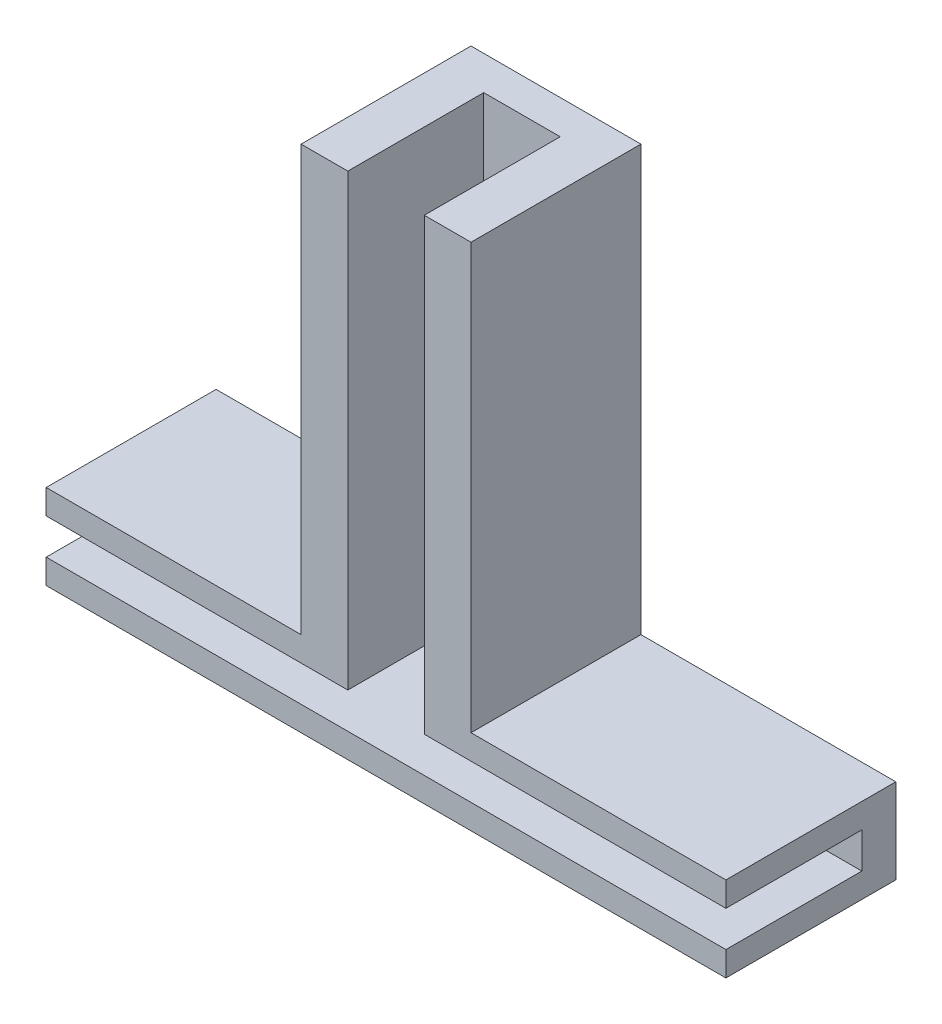
ISO-10303-21;
HEADER;
FILE_DESCRIPTION(('STEP AP214'),'2;1');
FILE_NAME('part.step','',(''),(''),'','','');
FILE_SCHEMA(('AUTOMOTIVE_DESIGN { 1 0 10303 214 1 1 1 1 }'));
ENDSEC;
DATA;
#1=APPLICATION_CONTEXT('core data for automotive mechanical design processes');
#2=APPLICATION_PROTOCOL_DEFINITION('international standard','automotive_design',2000,#1);
#3=PRODUCT_CONTEXT('',#1,'mechanical');
#4=PRODUCT('Part','Part','',(#3));
#5=PRODUCT_RELATED_PRODUCT_CATEGORY('part','',(#4));
#6=PRODUCT_DEFINITION_FORMATION('','',#4);
#7=PRODUCT_DEFINITION_CONTEXT('part definition',#1,'design');
#8=PRODUCT_DEFINITION('design','',#6,#7);
#9=PRODUCT_DEFINITION_SHAPE('','',#8);
#10=(LENGTH_UNIT() NAMED_UNIT(*) SI_UNIT(.MILLI.,.METRE.));
#11=(NAMED_UNIT(*) PLANE_ANGLE_UNIT() SI_UNIT($,.RADIAN.));
#12=(NAMED_UNIT(*) SI_UNIT($,.STERADIAN.) SOLID_ANGLE_UNIT());
#13=UNCERTAINTY_MEASURE_WITH_UNIT(LENGTH_MEASURE(1.E-05),#10,'distance_accuracy_value','');
#14=(GEOMETRIC_REPRESENTATION_CONTEXT(3) GLOBAL_UNCERTAINTY_ASSIGNED_CONTEXT((#13)) GLOBAL_UNIT_ASSIGNED_CONTEXT((#10,
#11,#12)) REPRESENTATION_CONTEXT('',''));
#15=CARTESIAN_POINT('',(0.,0.,0.));
#16=DIRECTION('',(0.,0.,1.));
#17=DIRECTION('',(1.,0.,0.));
#18=AXIS2_PLACEMENT_3D('',#15,#16,#17);
#19=CARTESIAN_POINT('',(-20.,5.,5.));
#20=DIRECTION('',(0.,0.,-1.));
#21=DIRECTION('',(-1.,0.,0.));
#22=AXIS2_PLACEMENT_3D('',#19,#20,#21);
#23=PLANE('',#22);
#24=DIRECTION('',(0.,-1.,0.));
#25=VECTOR('',#24,1.);
#26=CARTESIAN_POINT('',(2.25,0.,5.));
#27=LINE('',#26,#25);
#28=CARTESIAN_POINT('',(2.25,30.,5.));
#29=VERTEX_POINT('',#28);
#30=CARTESIAN_POINT('',(2.25,3.55,5.));
#31=VERTEX_POINT('',#30);
#32=EDGE_CURVE('E171',#29,#31,#27,.T.);
#33=ORIENTED_EDGE('',*,*,#32,.T.);
#34=DIRECTION('',(1.,0.,0.));
#35=VECTOR('',#34,1.);
#36=CARTESIAN_POINT('',(-20.,3.55,5.));
#37=LINE('',#36,#35);
#38=CARTESIAN_POINT('',(20.,3.55,5.));
#39=VERTEX_POINT('',#38);
#40=EDGE_CURVE('E220',#31,#39,#37,.T.);
#41=ORIENTED_EDGE('',*,*,#40,.T.);
#42=DIRECTION('',(0.,-1.,0.));
#43=VECTOR('',#42,1.);
#44=CARTESIAN_POINT('',(20.,5.,5.));
#45=LINE('',#44,#43);
#46=CARTESIAN_POINT('',(20.,5.,5.));
#47=VERTEX_POINT('',#46);
#48=EDGE_CURVE('E262',#47,#39,#45,.T.);
#49=ORIENTED_EDGE('',*,*,#48,.F.);
#50=DIRECTION('',(1.,0.,0.));
#51=VECTOR('',#50,1.);
#52=CARTESIAN_POINT('',(-20.,5.,5.));
#53=LINE('',#52,#51);
#54=CARTESIAN_POINT('',(5.,5.,5.));
#55=VERTEX_POINT('',#54);
#56=EDGE_CURVE('E248',#55,#47,#53,.T.);
#57=ORIENTED_EDGE('',*,*,#56,.F.);
#58=DIRECTION('',(0.,1.,0.));
#59=VECTOR('',#58,1.);
#60=CARTESIAN_POINT('',(5.,0.,5.));
#61=LINE('',#60,#59);
#62=CARTESIAN_POINT('',(5.,30.,5.));
#63=VERTEX_POINT('',#62);
#64=EDGE_CURVE('E183',#55,#63,#61,.T.);
#65=ORIENTED_EDGE('',*,*,#64,.T.);
#66=DIRECTION('',(-1.,0.,0.));
#67=VECTOR('',#66,1.);
#68=CARTESIAN_POINT('',(0.,30.,5.));
#69=LINE('',#68,#67);
#70=EDGE_CURVE('E190',#63,#29,#69,.T.);
#71=ORIENTED_EDGE('',*,*,#70,.T.);
#72=EDGE_LOOP('',(#33,#41,#49,#57,#65,#71));
#73=FACE_BOUND('',#72,.T.);
#74=ADVANCED_FACE('F43',(#73),#23,.F.);
#75=CARTESIAN_POINT('',(-20.,3.55,5.));
#76=DIRECTION('',(0.,1.,0.));
#77=DIRECTION('',(0.,0.,1.));
#78=AXIS2_PLACEMENT_3D('',#75,#76,#77);
#79=PLANE('',#78);
#80=DIRECTION('',(0.,0.,1.));
#81=VECTOR('',#80,1.);
#82=CARTESIAN_POINT('',(2.25,3.55,-3.));
#83=LINE('',#82,#81);
#84=CARTESIAN_POINT('',(2.25,3.55,-3.));
#85=VERTEX_POINT('',#84);
#86=EDGE_CURVE('E178',#85,#31,#83,.T.);
#87=ORIENTED_EDGE('',*,*,#86,.F.);
#88=DIRECTION('',(1.,0.,0.));
#89=VECTOR('',#88,1.);
#90=CARTESIAN_POINT('',(-20.,3.55,-3.));
#91=LINE('',#90,#89);
#92=CARTESIAN_POINT('',(20.,3.55,-3.));
#93=VERTEX_POINT('',#92);
#94=EDGE_CURVE('E230',#85,#93,#91,.T.);
#95=ORIENTED_EDGE('',*,*,#94,.T.);
#96=DIRECTION('',(0.,0.,1.));
#97=VECTOR('',#96,1.);
#98=CARTESIAN_POINT('',(20.,3.55,5.));
#99=LINE('',#98,#97);
#100=EDGE_CURVE('E204',#93,#39,#99,.T.);
#101=ORIENTED_EDGE('',*,*,#100,.T.);
#102=ORIENTED_EDGE('',*,*,#40,.F.);
#103=EDGE_LOOP('',(#87,#95,#101,#102));
#104=FACE_BOUND('',#103,.T.);
#105=ADVANCED_FACE('F319',(#104),#79,.F.);
#106=CARTESIAN_POINT('',(0.,30.,5.));
#107=DIRECTION('',(0.,-1.,0.));
#108=DIRECTION('',(0.,0.,-1.));
#109=AXIS2_PLACEMENT_3D('',#106,#107,#108);
#110=PLANE('',#109);
#111=DIRECTION('',(0.,0.,1.));
#112=VECTOR('',#111,1.);
#113=CARTESIAN_POINT('',(2.25,30.,-3.));
#114=LINE('',#113,#112);
#115=CARTESIAN_POINT('',(2.25,30.,-3.));
#116=VERTEX_POINT('',#115);
#117=EDGE_CURVE('E197',#116,#29,#114,.T.);
#118=ORIENTED_EDGE('',*,*,#117,.T.);
#119=ORIENTED_EDGE('',*,*,#70,.F.);
#120=DIRECTION('',(0.,0.,-1.));
#121=VECTOR('',#120,1.);
#122=CARTESIAN_POINT('',(5.,30.,5.));
#123=LINE('',#122,#121);
#124=CARTESIAN_POINT('',(5.,30.,-5.));
#125=VERTEX_POINT('',#124);
#126=EDGE_CURVE('E201',#63,#125,#123,.T.);
#127=ORIENTED_EDGE('',*,*,#126,.T.);
#128=DIRECTION('',(-1.,0.,0.));
#129=VECTOR('',#128,1.);
#130=CARTESIAN_POINT('',(0.,30.,-5.));
#131=LINE('',#130,#129);
#132=CARTESIAN_POINT('',(-5.,30.,-5.));
#133=VERTEX_POINT('',#132);
#134=EDGE_CURVE('E187',#125,#133,#131,.T.);
#135=ORIENTED_EDGE('',*,*,#134,.T.);
#136=DIRECTION('',(0.,0.,-1.));
#137=VECTOR('',#136,1.);
#138=CARTESIAN_POINT('',(-5.,30.,5.));
#139=LINE('',#138,#137);
#140=CARTESIAN_POINT('',(-5.,30.,5.));
#141=VERTEX_POINT('',#140);
#142=EDGE_CURVE('E205',#141,#133,#139,.T.);
#143=ORIENTED_EDGE('',*,*,#142,.F.);
#144=CARTESIAN_POINT('',(-2.25,30.,5.));
#145=VERTEX_POINT('',#144);
#146=EDGE_CURVE('E176',#145,#141,#69,.T.);
#147=ORIENTED_EDGE('',*,*,#146,.F.);
#148=DIRECTION('',(0.,0.,1.));
#149=VECTOR('',#148,1.);
#150=CARTESIAN_POINT('',(-2.25,30.,-3.));
#151=LINE('',#150,#149);
#152=CARTESIAN_POINT('',(-2.25,30.,-3.));
#153=VERTEX_POINT('',#152);
#154=EDGE_CURVE('E159',#153,#145,#151,.T.);
#155=ORIENTED_EDGE('',*,*,#154,.F.);
#156=DIRECTION('',(-1.,0.,0.));
#157=VECTOR('',#156,1.);
#158=CARTESIAN_POINT('',(0.,30.,-3.));
#159=LINE('',#158,#157);
#160=EDGE_CURVE('E164',#116,#153,#159,.T.);
#161=ORIENTED_EDGE('',*,*,#160,.F.);
#162=EDGE_LOOP('',(#118,#119,#127,#135,#143,#147,#155,#161));
#163=FACE_BOUND('',#162,.T.);
#164=ADVANCED_FACE('F174',(#163),#110,.F.);
#165=CARTESIAN_POINT('',(0.,5.,0.));
#166=DIRECTION('',(0.,-1.,0.));
#167=DIRECTION('',(0.,0.,-1.));
#168=AXIS2_PLACEMENT_3D('',#165,#166,#167);
#169=PLANE('',#168);
#170=DIRECTION('',(0.,0.,-1.));
#171=VECTOR('',#170,1.);
#172=CARTESIAN_POINT('',(5.,5.,5.));
#173=LINE('',#172,#171);
#174=CARTESIAN_POINT('',(5.,5.,-5.));
#175=VERTEX_POINT('',#174);
#176=EDGE_CURVE('E193',#55,#175,#173,.T.);
#177=ORIENTED_EDGE('',*,*,#176,.F.);
#178=ORIENTED_EDGE('',*,*,#56,.T.);
#179=DIRECTION('',(0.,0.,-1.));
#180=VECTOR('',#179,1.);
#181=CARTESIAN_POINT('',(20.,5.,5.));
#182=LINE('',#181,#180);
#183=CARTESIAN_POINT('',(20.,5.,-5.));
#184=VERTEX_POINT('',#183);
#185=EDGE_CURVE('E238',#47,#184,#182,.T.);
#186=ORIENTED_EDGE('',*,*,#185,.T.);
#187=DIRECTION('',(-1.,0.,0.));
#188=VECTOR('',#187,1.);
#189=CARTESIAN_POINT('',(-20.,5.,-5.));
#190=LINE('',#189,#188);
#191=EDGE_CURVE('E243',#184,#175,#190,.T.);
#192=ORIENTED_EDGE('',*,*,#191,.T.);
#193=EDGE_LOOP('',(#177,#178,#186,#192));
#194=FACE_BOUND('',#193,.T.);
#195=ADVANCED_FACE('F308',(#194),#169,.F.);
#196=CARTESIAN_POINT('',(-20.,3.55,5.));
#197=VERTEX_POINT('',#196);
#198=CARTESIAN_POINT('',(-2.25,3.55,5.));
#199=VERTEX_POINT('',#198);
#200=EDGE_CURVE('E235',#197,#199,#37,.T.);
#201=ORIENTED_EDGE('',*,*,#200,.T.);
#202=DIRECTION('',(0.,-1.,0.));
#203=VECTOR('',#202,1.);
#204=CARTESIAN_POINT('',(-2.25,0.,5.));
#205=LINE('',#204,#203);
#206=EDGE_CURVE('E324',#145,#199,#205,.T.);
#207=ORIENTED_EDGE('',*,*,#206,.F.);
#208=ORIENTED_EDGE('',*,*,#146,.T.);
#209=DIRECTION('',(0.,1.,0.));
#210=VECTOR('',#209,1.);
#211=CARTESIAN_POINT('',(-5.,0.,5.));
#212=LINE('',#211,#210);
#213=CARTESIAN_POINT('',(-5.,5.,5.));
#214=VERTEX_POINT('',#213);
#215=EDGE_CURVE('E186',#214,#141,#212,.T.);
#216=ORIENTED_EDGE('',*,*,#215,.F.);
#217=CARTESIAN_POINT('',(-20.,5.,5.));
#218=VERTEX_POINT('',#217);
#219=EDGE_CURVE('E249',#218,#214,#53,.T.);
#220=ORIENTED_EDGE('',*,*,#219,.F.);
#221=DIRECTION('',(0.,-1.,0.));
#222=VECTOR('',#221,1.);
#223=CARTESIAN_POINT('',(-20.,5.,5.));
#224=LINE('',#223,#222);
#225=EDGE_CURVE('E266',#218,#197,#224,.T.);
#226=ORIENTED_EDGE('',*,*,#225,.T.);
#227=EDGE_LOOP('',(#201,#207,#208,#216,#220,#226));
#228=FACE_BOUND('',#227,.T.);
#229=ADVANCED_FACE('F296',(#228),#23,.F.);
#230=CARTESIAN_POINT('',(20.,5.,5.));
#231=DIRECTION('',(-1.,0.,0.));
#232=DIRECTION('',(0.,0.,1.));
#233=AXIS2_PLACEMENT_3D('',#230,#231,#232);
#234=PLANE('',#233);
#235=ORIENTED_EDGE('',*,*,#48,.T.);
#236=ORIENTED_EDGE('',*,*,#100,.F.);
#237=DIRECTION('',(0.,1.,0.));
#238=VECTOR('',#237,1.);
#239=CARTESIAN_POINT('',(20.,3.55,-3.));
#240=LINE('',#239,#238);
#241=CARTESIAN_POINT('',(20.,1.45,-3.));
#242=VERTEX_POINT('',#241);
#243=EDGE_CURVE('E214',#242,#93,#240,.T.);
#244=ORIENTED_EDGE('',*,*,#243,.F.);
#245=DIRECTION('',(0.,0.,-1.));
#246=VECTOR('',#245,1.);
#247=CARTESIAN_POINT('',(20.,1.45,5.));
#248=LINE('',#247,#246);
#249=CARTESIAN_POINT('',(20.,1.45,5.));
#250=VERTEX_POINT('',#249);
#251=EDGE_CURVE('E223',#250,#242,#248,.T.);
#252=ORIENTED_EDGE('',*,*,#251,.F.);
#253=CARTESIAN_POINT('',(20.,0.,5.));
#254=VERTEX_POINT('',#253);
#255=EDGE_CURVE('E252',#250,#254,#45,.T.);
#256=ORIENTED_EDGE('',*,*,#255,.T.);
#257=DIRECTION('',(0.,0.,-1.));
#258=VECTOR('',#257,1.);
#259=CARTESIAN_POINT('',(20.,0.,5.));
#260=LINE('',#259,#258);
#261=CARTESIAN_POINT('',(20.,0.,-5.));
#262=VERTEX_POINT('',#261);
#263=EDGE_CURVE('E229',#254,#262,#260,.T.);
#264=ORIENTED_EDGE('',*,*,#263,.T.);
#265=DIRECTION('',(0.,-1.,0.));
#266=VECTOR('',#265,1.);
#267=CARTESIAN_POINT('',(20.,5.,-5.));
#268=LINE('',#267,#266);
#269=EDGE_CURVE('E11',#184,#262,#268,.T.);
#270=ORIENTED_EDGE('',*,*,#269,.F.);
#271=ORIENTED_EDGE('',*,*,#185,.F.);
#272=EDGE_LOOP('',(#235,#236,#244,#252,#256,#264,#270,#271));
#273=FACE_BOUND('',#272,.T.);
#274=ADVANCED_FACE('F45',(#273),#234,.F.);
#275=CARTESIAN_POINT('',(-20.,5.,-5.));
#276=DIRECTION('',(0.,0.,1.));
#277=DIRECTION('',(1.,0.,0.));
#278=AXIS2_PLACEMENT_3D('',#275,#276,#277);
#279=PLANE('',#278);
#280=DIRECTION('',(-1.,0.,0.));
#281=VECTOR('',#280,1.);
#282=CARTESIAN_POINT('',(-20.,0.,-5.));
#283=LINE('',#282,#281);
#284=CARTESIAN_POINT('',(-20.,0.,-5.));
#285=VERTEX_POINT('',#284);
#286=EDGE_CURVE('E255',#262,#285,#283,.T.);
#287=ORIENTED_EDGE('',*,*,#286,.T.);
#288=DIRECTION('',(0.,-1.,0.));
#289=VECTOR('',#288,1.);
#290=CARTESIAN_POINT('',(-20.,5.,-5.));
#291=LINE('',#290,#289);
#292=CARTESIAN_POINT('',(-20.,5.,-5.));
#293=VERTEX_POINT('',#292);
#294=EDGE_CURVE('E51',#293,#285,#291,.T.);
#295=ORIENTED_EDGE('',*,*,#294,.F.);
#296=CARTESIAN_POINT('',(-5.,5.,-5.));
#297=VERTEX_POINT('',#296);
#298=EDGE_CURVE('E241',#297,#293,#190,.T.);
#299=ORIENTED_EDGE('',*,*,#298,.F.);
#300=DIRECTION('',(0.,1.,0.));
#301=VECTOR('',#300,1.);
#302=CARTESIAN_POINT('',(-5.,0.,-5.));
#303=LINE('',#302,#301);
#304=EDGE_CURVE('E66',#297,#133,#303,.T.);
#305=ORIENTED_EDGE('',*,*,#304,.T.);
#306=ORIENTED_EDGE('',*,*,#134,.F.);
#307=DIRECTION('',(0.,1.,0.));
#308=VECTOR('',#307,1.);
#309=CARTESIAN_POINT('',(5.,0.,-5.));
#310=LINE('',#309,#308);
#311=EDGE_CURVE('E194',#175,#125,#310,.T.);
#312=ORIENTED_EDGE('',*,*,#311,.F.);
#313=ORIENTED_EDGE('',*,*,#191,.F.);
#314=ORIENTED_EDGE('',*,*,#269,.T.);
#315=EDGE_LOOP('',(#287,#295,#299,#305,#306,#312,#313,#314));
#316=FACE_BOUND('',#315,.T.);
#317=ADVANCED_FACE('F300',(#316),#279,.F.);
#318=CARTESIAN_POINT('',(-20.,5.,5.));
#319=DIRECTION('',(1.,0.,0.));
#320=DIRECTION('',(0.,0.,-1.));
#321=AXIS2_PLACEMENT_3D('',#318,#319,#320);
#322=PLANE('',#321);
#323=DIRECTION('',(0.,1.,0.));
#324=VECTOR('',#323,1.);
#325=CARTESIAN_POINT('',(-20.,3.55,-3.));
#326=LINE('',#325,#324);
#327=CARTESIAN_POINT('',(-20.,1.45,-3.));
#328=VERTEX_POINT('',#327);
#329=CARTESIAN_POINT('',(-20.,3.55,-3.));
#330=VERTEX_POINT('',#329);
#331=EDGE_CURVE('E217',#328,#330,#326,.T.);
#332=ORIENTED_EDGE('',*,*,#331,.T.);
#333=DIRECTION('',(0.,0.,1.));
#334=VECTOR('',#333,1.);
#335=CARTESIAN_POINT('',(-20.,3.55,5.));
#336=LINE('',#335,#334);
#337=EDGE_CURVE('E210',#330,#197,#336,.T.);
#338=ORIENTED_EDGE('',*,*,#337,.T.);
#339=ORIENTED_EDGE('',*,*,#225,.F.);
#340=DIRECTION('',(0.,0.,1.));
#341=VECTOR('',#340,1.);
#342=CARTESIAN_POINT('',(-20.,5.,5.));
#343=LINE('',#342,#341);
#344=EDGE_CURVE('E246',#293,#218,#343,.T.);
#345=ORIENTED_EDGE('',*,*,#344,.F.);
#346=ORIENTED_EDGE('',*,*,#294,.T.);
#347=DIRECTION('',(0.,0.,1.));
#348=VECTOR('',#347,1.);
#349=CARTESIAN_POINT('',(-20.,0.,5.));
#350=LINE('',#349,#348);
#351=CARTESIAN_POINT('',(-20.,0.,5.));
#352=VERTEX_POINT('',#351);
#353=EDGE_CURVE('E257',#285,#352,#350,.T.);
#354=ORIENTED_EDGE('',*,*,#353,.T.);
#355=CARTESIAN_POINT('',(-20.,1.45,5.));
#356=VERTEX_POINT('',#355);
#357=EDGE_CURVE('E265',#356,#352,#224,.T.);
#358=ORIENTED_EDGE('',*,*,#357,.F.);
#359=DIRECTION('',(0.,0.,-1.));
#360=VECTOR('',#359,1.);
#361=CARTESIAN_POINT('',(-20.,1.45,5.));
#362=LINE('',#361,#360);
#363=EDGE_CURVE('E213',#356,#328,#362,.T.);
#364=ORIENTED_EDGE('',*,*,#363,.T.);
#365=EDGE_LOOP('',(#332,#338,#339,#345,#346,#354,#358,#364));
#366=FACE_BOUND('',#365,.T.);
#367=ADVANCED_FACE('F273',(#366),#322,.F.);
#368=ORIENTED_EDGE('',*,*,#255,.F.);
#369=DIRECTION('',(1.,0.,0.));
#370=VECTOR('',#369,1.);
#371=CARTESIAN_POINT('',(-20.,1.45,5.));
#372=LINE('',#371,#370);
#373=EDGE_CURVE('E233',#356,#250,#372,.T.);
#374=ORIENTED_EDGE('',*,*,#373,.F.);
#375=ORIENTED_EDGE('',*,*,#357,.T.);
#376=DIRECTION('',(1.,0.,0.));
#377=VECTOR('',#376,1.);
#378=CARTESIAN_POINT('',(-20.,0.,5.));
#379=LINE('',#378,#377);
#380=EDGE_CURVE('E242',#352,#254,#379,.T.);
#381=ORIENTED_EDGE('',*,*,#380,.T.);
#382=EDGE_LOOP('',(#368,#374,#375,#381));
#383=FACE_BOUND('',#382,.T.);
#384=ADVANCED_FACE('F284',(#383),#23,.F.);
#385=ORIENTED_EDGE('',*,*,#219,.T.);
#386=DIRECTION('',(0.,0.,-1.));
#387=VECTOR('',#386,1.);
#388=CARTESIAN_POINT('',(-5.,5.,5.));
#389=LINE('',#388,#387);
#390=EDGE_CURVE('E207',#214,#297,#389,.T.);
#391=ORIENTED_EDGE('',*,*,#390,.T.);
#392=ORIENTED_EDGE('',*,*,#298,.T.);
#393=ORIENTED_EDGE('',*,*,#344,.T.);
#394=EDGE_LOOP('',(#385,#391,#392,#393));
#395=FACE_BOUND('',#394,.T.);
#396=ADVANCED_FACE('F299',(#395),#169,.F.);
#397=CARTESIAN_POINT('',(0.,0.,0.));
#398=DIRECTION('',(0.,-1.,0.));
#399=DIRECTION('',(0.,0.,-1.));
#400=AXIS2_PLACEMENT_3D('',#397,#398,#399);
#401=PLANE('',#400);
#402=ORIENTED_EDGE('',*,*,#263,.F.);
#403=ORIENTED_EDGE('',*,*,#380,.F.);
#404=ORIENTED_EDGE('',*,*,#353,.F.);
#405=ORIENTED_EDGE('',*,*,#286,.F.);
#406=EDGE_LOOP('',(#402,#403,#404,#405));
#407=FACE_BOUND('',#406,.T.);
#408=ADVANCED_FACE('F281',(#407),#401,.T.);
#409=CARTESIAN_POINT('',(-2.25,3.55,-3.));
#410=VERTEX_POINT('',#409);
#411=EDGE_CURVE('E227',#330,#410,#91,.T.);
#412=ORIENTED_EDGE('',*,*,#411,.T.);
#413=DIRECTION('',(0.,0.,1.));
#414=VECTOR('',#413,1.);
#415=CARTESIAN_POINT('',(-2.25,3.55,-3.));
#416=LINE('',#415,#414);
#417=EDGE_CURVE('E162',#410,#199,#416,.T.);
#418=ORIENTED_EDGE('',*,*,#417,.T.);
#419=ORIENTED_EDGE('',*,*,#200,.F.);
#420=ORIENTED_EDGE('',*,*,#337,.F.);
#421=EDGE_LOOP('',(#412,#418,#419,#420));
#422=FACE_BOUND('',#421,.T.);
#423=ADVANCED_FACE('F293',(#422),#79,.F.);
#424=CARTESIAN_POINT('',(-20.,3.55,-3.));
#425=DIRECTION('',(0.,0.,-1.));
#426=DIRECTION('',(0.,1.,0.));
#427=AXIS2_PLACEMENT_3D('',#424,#425,#426);
#428=PLANE('',#427);
#429=ORIENTED_EDGE('',*,*,#243,.T.);
#430=ORIENTED_EDGE('',*,*,#94,.F.);
#431=DIRECTION('',(0.,-1.,0.));
#432=VECTOR('',#431,1.);
#433=CARTESIAN_POINT('',(2.25,0.,-3.));
#434=LINE('',#433,#432);
#435=EDGE_CURVE('E58',#116,#85,#434,.T.);
#436=ORIENTED_EDGE('',*,*,#435,.F.);
#437=ORIENTED_EDGE('',*,*,#160,.T.);
#438=DIRECTION('',(0.,-1.,0.));
#439=VECTOR('',#438,1.);
#440=CARTESIAN_POINT('',(-2.25,0.,-3.));
#441=LINE('',#440,#439);
#442=EDGE_CURVE('E156',#153,#410,#441,.T.);
#443=ORIENTED_EDGE('',*,*,#442,.T.);
#444=ORIENTED_EDGE('',*,*,#411,.F.);
#445=ORIENTED_EDGE('',*,*,#331,.F.);
#446=DIRECTION('',(1.,0.,0.));
#447=VECTOR('',#446,1.);
#448=CARTESIAN_POINT('',(-20.,1.45,-3.));
#449=LINE('',#448,#447);
#450=EDGE_CURVE('E231',#328,#242,#449,.T.);
#451=ORIENTED_EDGE('',*,*,#450,.T.);
#452=EDGE_LOOP('',(#429,#430,#436,#437,#443,#444,#445,#451));
#453=FACE_BOUND('',#452,.T.);
#454=ADVANCED_FACE('F168',(#453),#428,.F.);
#455=CARTESIAN_POINT('',(-20.,1.45,5.));
#456=DIRECTION('',(0.,-1.,0.));
#457=DIRECTION('',(0.,0.,-1.));
#458=AXIS2_PLACEMENT_3D('',#455,#456,#457);
#459=PLANE('',#458);
#460=ORIENTED_EDGE('',*,*,#251,.T.);
#461=ORIENTED_EDGE('',*,*,#450,.F.);
#462=ORIENTED_EDGE('',*,*,#363,.F.);
#463=ORIENTED_EDGE('',*,*,#373,.T.);
#464=EDGE_LOOP('',(#460,#461,#462,#463));
#465=FACE_BOUND('',#464,.T.);
#466=ADVANCED_FACE('F288',(#465),#459,.F.);
#467=CARTESIAN_POINT('',(5.,0.,5.));
#468=DIRECTION('',(-1.,0.,0.));
#469=DIRECTION('',(0.,0.,1.));
#470=AXIS2_PLACEMENT_3D('',#467,#468,#469);
#471=PLANE('',#470);
#472=ORIENTED_EDGE('',*,*,#311,.T.);
#473=ORIENTED_EDGE('',*,*,#126,.F.);
#474=ORIENTED_EDGE('',*,*,#64,.F.);
#475=ORIENTED_EDGE('',*,*,#176,.T.);
#476=EDGE_LOOP('',(#472,#473,#474,#475));
#477=FACE_BOUND('',#476,.T.);
#478=ADVANCED_FACE('F304',(#477),#471,.F.);
#479=CARTESIAN_POINT('',(-5.,0.,5.));
#480=DIRECTION('',(-1.,0.,0.));
#481=DIRECTION('',(0.,0.,1.));
#482=AXIS2_PLACEMENT_3D('',#479,#480,#481);
#483=PLANE('',#482);
#484=ORIENTED_EDGE('',*,*,#304,.F.);
#485=ORIENTED_EDGE('',*,*,#390,.F.);
#486=ORIENTED_EDGE('',*,*,#215,.T.);
#487=ORIENTED_EDGE('',*,*,#142,.T.);
#488=EDGE_LOOP('',(#484,#485,#486,#487));
#489=FACE_BOUND('',#488,.T.);
#490=ADVANCED_FACE('F325',(#489),#483,.T.);
#491=CARTESIAN_POINT('',(2.25,0.,-3.));
#492=DIRECTION('',(-1.,0.,0.));
#493=DIRECTION('',(0.,0.,1.));
#494=AXIS2_PLACEMENT_3D('',#491,#492,#493);
#495=PLANE('',#494);
#496=ORIENTED_EDGE('',*,*,#32,.F.);
#497=ORIENTED_EDGE('',*,*,#117,.F.);
#498=ORIENTED_EDGE('',*,*,#435,.T.);
#499=ORIENTED_EDGE('',*,*,#86,.T.);
#500=EDGE_LOOP('',(#496,#497,#498,#499));
#501=FACE_BOUND('',#500,.T.);
#502=ADVANCED_FACE('F327',(#501),#495,.T.);
#503=CARTESIAN_POINT('',(-2.25,0.,-3.));
#504=DIRECTION('',(-1.,0.,0.));
#505=DIRECTION('',(0.,0.,1.));
#506=AXIS2_PLACEMENT_3D('',#503,#504,#505);
#507=PLANE('',#506);
#508=ORIENTED_EDGE('',*,*,#206,.T.);
#509=ORIENTED_EDGE('',*,*,#417,.F.);
#510=ORIENTED_EDGE('',*,*,#442,.F.);
#511=ORIENTED_EDGE('',*,*,#154,.T.);
#512=EDGE_LOOP('',(#508,#509,#510,#511));
#513=FACE_BOUND('',#512,.T.);
#514=ADVANCED_FACE('F157',(#513),#507,.F.);
#515=CLOSED_SHELL('',(#74,#105,#164,#195,#229,#274,#317,#367,#384,#396,#408,#423,#454,#466,#478,
#490,#502,#514));
#516=MANIFOLD_SOLID_BREP('B2',#515);
#517=ADVANCED_BREP_SHAPE_REPRESENTATION('',(#18,#516),#14);
#518=SHAPE_DEFINITION_REPRESENTATION(#9,#517);
ENDSEC;
END-ISO-10303-21;
